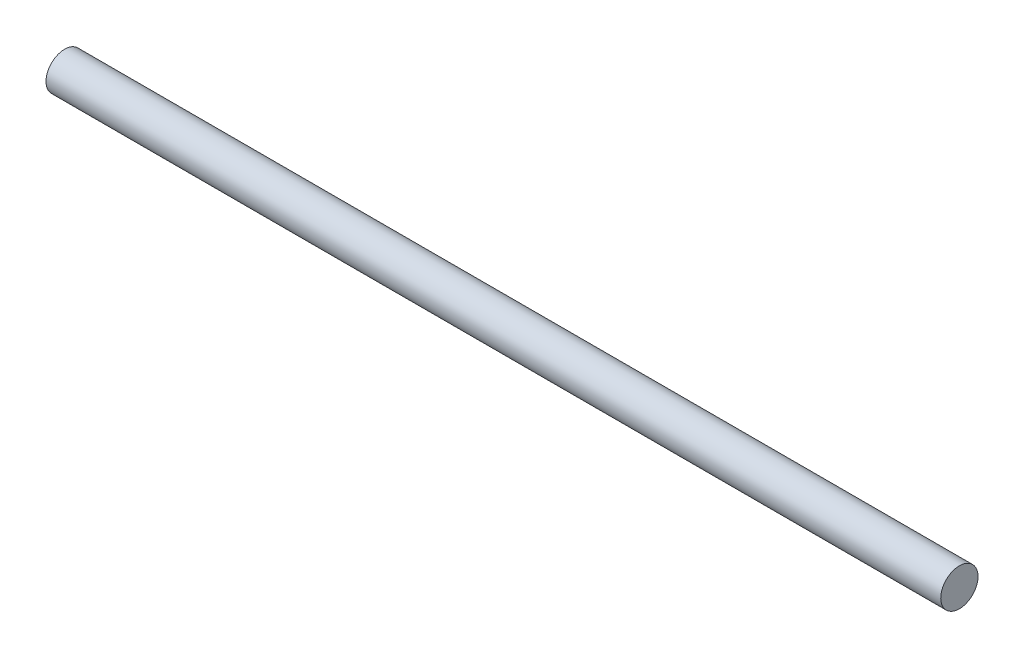
ISO-10303-21;
HEADER;
FILE_DESCRIPTION(('STEP AP214'),'2;1');
FILE_NAME('part.step','',(''),(''),'','','');
FILE_SCHEMA(('AUTOMOTIVE_DESIGN { 1 0 10303 214 1 1 1 1 }'));
ENDSEC;
DATA;
#1=APPLICATION_CONTEXT('core data for automotive mechanical design processes');
#2=APPLICATION_PROTOCOL_DEFINITION('international standard','automotive_design',2000,#1);
#3=PRODUCT_CONTEXT('',#1,'mechanical');
#4=PRODUCT('Part','Part','',(#3));
#5=PRODUCT_RELATED_PRODUCT_CATEGORY('part','',(#4));
#6=PRODUCT_DEFINITION_FORMATION('','',#4);
#7=PRODUCT_DEFINITION_CONTEXT('part definition',#1,'design');
#8=PRODUCT_DEFINITION('design','',#6,#7);
#9=PRODUCT_DEFINITION_SHAPE('','',#8);
#10=(LENGTH_UNIT() NAMED_UNIT(*) SI_UNIT(.MILLI.,.METRE.));
#11=(NAMED_UNIT(*) PLANE_ANGLE_UNIT() SI_UNIT($,.RADIAN.));
#12=(NAMED_UNIT(*) SI_UNIT($,.STERADIAN.) SOLID_ANGLE_UNIT());
#13=UNCERTAINTY_MEASURE_WITH_UNIT(LENGTH_MEASURE(1.E-05),#10,'distance_accuracy_value','');
#14=(GEOMETRIC_REPRESENTATION_CONTEXT(3) GLOBAL_UNCERTAINTY_ASSIGNED_CONTEXT((#13)) GLOBAL_UNIT_ASSIGNED_CONTEXT((#10,
#11,#12)) REPRESENTATION_CONTEXT('',''));
#15=CARTESIAN_POINT('',(0.,0.,0.));
#16=DIRECTION('',(0.,0.,1.));
#17=DIRECTION('',(1.,0.,0.));
#18=AXIS2_PLACEMENT_3D('',#15,#16,#17);
#19=CARTESIAN_POINT('',(47.975000062,140.175,30.475));
#20=DIRECTION('',(-1.,0.,0.));
#21=DIRECTION('',(0.,0.,1.));
#22=AXIS2_PLACEMENT_3D('',#19,#20,#21);
#23=PLANE('',#22);
#24=CARTESIAN_POINT('',(47.975000062,96.1169830943412,0.47999999999996));
#25=DIRECTION('',(-1.,0.,0.));
#26=DIRECTION('',(0.,0.,1.));
#27=AXIS2_PLACEMENT_3D('',#24,#25,#26);
#28=CIRCLE('',#27,2.);
#29=CARTESIAN_POINT('',(47.975000062,96.1169830943412,2.47999999999996));
#30=VERTEX_POINT('',#29);
#31=EDGE_CURVE('E46',#30,#30,#28,.F.);
#32=ORIENTED_EDGE('',*,*,#31,.T.);
#33=EDGE_LOOP('',(#32));
#34=FACE_BOUND('',#33,.T.);
#35=ADVANCED_FACE('F39',(#34),#23,.F.);
#36=CARTESIAN_POINT('',(-47.975000062,56.813409305375,-30.475));
#37=DIRECTION('',(1.,0.,0.));
#38=DIRECTION('',(0.,0.,-1.));
#39=AXIS2_PLACEMENT_3D('',#36,#37,#38);
#40=PLANE('',#39);
#41=CARTESIAN_POINT('',(-47.975000062,96.1169830943412,0.47999999999996));
#42=DIRECTION('',(1.,0.,0.));
#43=DIRECTION('',(0.,0.,-1.));
#44=AXIS2_PLACEMENT_3D('',#41,#42,#43);
#45=CIRCLE('',#44,2.);
#46=CARTESIAN_POINT('',(-47.975000062,96.1169830943412,-1.52000000000004));
#47=VERTEX_POINT('',#46);
#48=EDGE_CURVE('E10',#47,#47,#45,.F.);
#49=ORIENTED_EDGE('',*,*,#48,.T.);
#50=EDGE_LOOP('',(#49));
#51=FACE_BOUND('',#50,.T.);
#52=ADVANCED_FACE('F54',(#51),#40,.F.);
#53=CARTESIAN_POINT('',(77.,96.1169830943412,0.47999999999996));
#54=DIRECTION('',(-1.,0.,0.));
#55=DIRECTION('',(0.,0.,1.));
#56=AXIS2_PLACEMENT_3D('',#53,#54,#55);
#57=CYLINDRICAL_SURFACE('',#56,2.);
#58=ORIENTED_EDGE('',*,*,#48,.F.);
#59=EDGE_LOOP('',(#58));
#60=FACE_BOUND('',#59,.T.);
#61=ORIENTED_EDGE('',*,*,#31,.F.);
#62=EDGE_LOOP('',(#61));
#63=FACE_BOUND('',#62,.T.);
#64=ADVANCED_FACE('F41',(#60,#63),#57,.T.);
#65=CLOSED_SHELL('',(#35,#52,#64));
#66=MANIFOLD_SOLID_BREP('B2',#65);
#67=ADVANCED_BREP_SHAPE_REPRESENTATION('',(#18,#66),#14);
#68=SHAPE_DEFINITION_REPRESENTATION(#9,#67);
ENDSEC;
END-ISO-10303-21;
